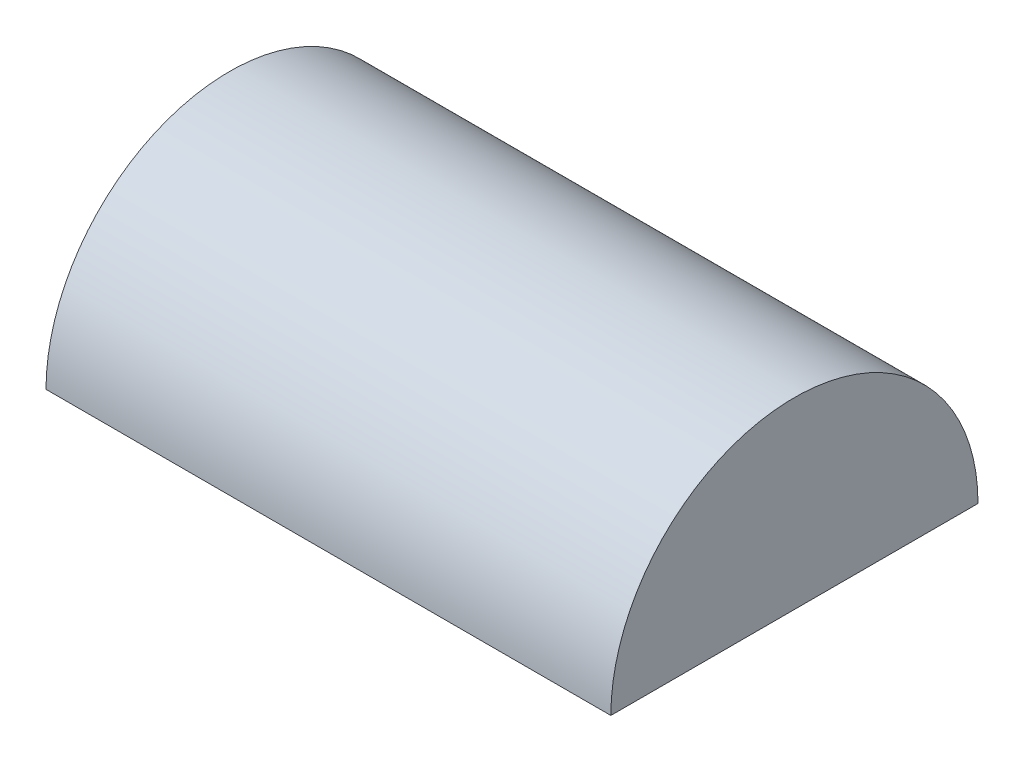
ISO-10303-21;
HEADER;
FILE_DESCRIPTION(('STEP AP214'),'2;1');
FILE_NAME('part.step','',(''),(''),'','','');
FILE_SCHEMA(('AUTOMOTIVE_DESIGN { 1 0 10303 214 1 1 1 1 }'));
ENDSEC;
DATA;
#1=APPLICATION_CONTEXT('core data for automotive mechanical design processes');
#2=APPLICATION_PROTOCOL_DEFINITION('international standard','automotive_design',2000,#1);
#3=PRODUCT_CONTEXT('',#1,'mechanical');
#4=PRODUCT('Part','Part','',(#3));
#5=PRODUCT_RELATED_PRODUCT_CATEGORY('part','',(#4));
#6=PRODUCT_DEFINITION_FORMATION('','',#4);
#7=PRODUCT_DEFINITION_CONTEXT('part definition',#1,'design');
#8=PRODUCT_DEFINITION('design','',#6,#7);
#9=PRODUCT_DEFINITION_SHAPE('','',#8);
#10=(LENGTH_UNIT() NAMED_UNIT(*) SI_UNIT(.MILLI.,.METRE.));
#11=(NAMED_UNIT(*) PLANE_ANGLE_UNIT() SI_UNIT($,.RADIAN.));
#12=(NAMED_UNIT(*) SI_UNIT($,.STERADIAN.) SOLID_ANGLE_UNIT());
#13=UNCERTAINTY_MEASURE_WITH_UNIT(LENGTH_MEASURE(1.E-05),#10,'distance_accuracy_value','');
#14=(GEOMETRIC_REPRESENTATION_CONTEXT(3) GLOBAL_UNCERTAINTY_ASSIGNED_CONTEXT((#13)) GLOBAL_UNIT_ASSIGNED_CONTEXT((#10,
#11,#12)) REPRESENTATION_CONTEXT('',''));
#15=CARTESIAN_POINT('',(0.,0.,0.));
#16=DIRECTION('',(0.,0.,1.));
#17=DIRECTION('',(1.,0.,0.));
#18=AXIS2_PLACEMENT_3D('',#15,#16,#17);
#19=CARTESIAN_POINT('',(60.,0.,0.));
#20=DIRECTION('',(-1.,0.,0.));
#21=DIRECTION('',(0.,0.,1.));
#22=AXIS2_PLACEMENT_3D('',#19,#20,#21);
#23=CYLINDRICAL_SURFACE('',#22,19.5);
#24=DIRECTION('',(-1.,0.,0.));
#25=VECTOR('',#24,1.);
#26=CARTESIAN_POINT('',(60.,0.,19.5));
#27=LINE('',#26,#25);
#28=CARTESIAN_POINT('',(60.,0.,19.5));
#29=VERTEX_POINT('',#28);
#30=CARTESIAN_POINT('',(0.,0.,19.5));
#31=VERTEX_POINT('',#30);
#32=EDGE_CURVE('E45',#29,#31,#27,.T.);
#33=ORIENTED_EDGE('',*,*,#32,.F.);
#34=CARTESIAN_POINT('',(60.,0.,0.));
#35=DIRECTION('',(1.,0.,0.));
#36=DIRECTION('',(0.,0.,-1.));
#37=AXIS2_PLACEMENT_3D('',#34,#35,#36);
#38=CIRCLE('',#37,19.5);
#39=CARTESIAN_POINT('',(60.,0.,-19.5));
#40=VERTEX_POINT('',#39);
#41=EDGE_CURVE('E39',#40,#29,#38,.T.);
#42=ORIENTED_EDGE('',*,*,#41,.F.);
#43=DIRECTION('',(-1.,0.,0.));
#44=VECTOR('',#43,1.);
#45=CARTESIAN_POINT('',(60.,0.,-19.5));
#46=LINE('',#45,#44);
#47=CARTESIAN_POINT('',(0.,0.,-19.5));
#48=VERTEX_POINT('',#47);
#49=EDGE_CURVE('E50',#48,#40,#46,.F.);
#50=ORIENTED_EDGE('',*,*,#49,.F.);
#51=CARTESIAN_POINT('',(0.,0.,0.));
#52=DIRECTION('',(1.,0.,0.));
#53=DIRECTION('',(0.,0.,-1.));
#54=AXIS2_PLACEMENT_3D('',#51,#52,#53);
#55=CIRCLE('',#54,19.5);
#56=EDGE_CURVE('E61',#48,#31,#55,.T.);
#57=ORIENTED_EDGE('',*,*,#56,.T.);
#58=EDGE_LOOP('',(#33,#42,#50,#57));
#59=FACE_BOUND('',#58,.T.);
#60=ADVANCED_FACE('F32',(#59),#23,.T.);
#61=CARTESIAN_POINT('',(60.,0.,0.));
#62=DIRECTION('',(1.,0.,0.));
#63=DIRECTION('',(0.,0.,-1.));
#64=AXIS2_PLACEMENT_3D('',#61,#62,#63);
#65=PLANE('',#64);
#66=ORIENTED_EDGE('',*,*,#41,.T.);
#67=DIRECTION('',(0.,0.,-1.));
#68=VECTOR('',#67,1.);
#69=CARTESIAN_POINT('',(60.,0.,0.));
#70=LINE('',#69,#68);
#71=EDGE_CURVE('E63',#29,#40,#70,.T.);
#72=ORIENTED_EDGE('',*,*,#71,.T.);
#73=EDGE_LOOP('',(#66,#72));
#74=FACE_BOUND('',#73,.T.);
#75=ADVANCED_FACE('F70',(#74),#65,.T.);
#76=CARTESIAN_POINT('',(0.,0.,0.));
#77=DIRECTION('',(1.,0.,0.));
#78=DIRECTION('',(0.,0.,-1.));
#79=AXIS2_PLACEMENT_3D('',#76,#77,#78);
#80=PLANE('',#79);
#81=DIRECTION('',(0.,0.,-1.));
#82=VECTOR('',#81,1.);
#83=CARTESIAN_POINT('',(0.,0.,0.));
#84=LINE('',#83,#82);
#85=EDGE_CURVE('E11',#31,#48,#84,.T.);
#86=ORIENTED_EDGE('',*,*,#85,.F.);
#87=ORIENTED_EDGE('',*,*,#56,.F.);
#88=EDGE_LOOP('',(#86,#87));
#89=FACE_BOUND('',#88,.T.);
#90=ADVANCED_FACE('F65',(#89),#80,.F.);
#91=CARTESIAN_POINT('',(101.,0.,21.3976557164887));
#92=DIRECTION('',(0.,-1.,0.));
#93=DIRECTION('',(0.,0.,-1.));
#94=AXIS2_PLACEMENT_3D('',#91,#92,#93);
#95=PLANE('',#94);
#96=ORIENTED_EDGE('',*,*,#32,.T.);
#97=ORIENTED_EDGE('',*,*,#85,.T.);
#98=ORIENTED_EDGE('',*,*,#49,.T.);
#99=ORIENTED_EDGE('',*,*,#71,.F.);
#100=EDGE_LOOP('',(#96,#97,#98,#99));
#101=FACE_BOUND('',#100,.T.);
#102=ADVANCED_FACE('F55',(#101),#95,.T.);
#103=CLOSED_SHELL('',(#60,#75,#90,#102));
#104=MANIFOLD_SOLID_BREP('B2',#103);
#105=ADVANCED_BREP_SHAPE_REPRESENTATION('',(#18,#104),#14);
#106=SHAPE_DEFINITION_REPRESENTATION(#9,#105);
ENDSEC;
END-ISO-10303-21;
